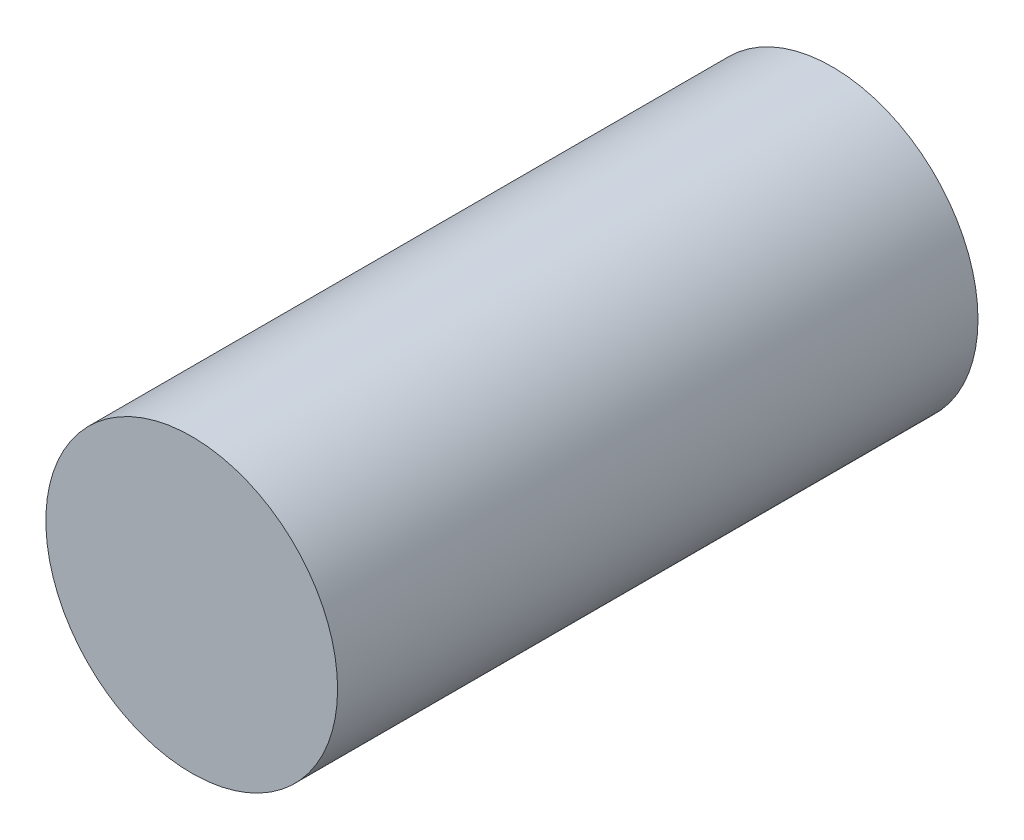
ISO-10303-21;
HEADER;
FILE_DESCRIPTION(('STEP AP214'),'2;1');
FILE_NAME('part.step','',(''),(''),'','','');
FILE_SCHEMA(('AUTOMOTIVE_DESIGN { 1 0 10303 214 1 1 1 1 }'));
ENDSEC;
DATA;
#1=APPLICATION_CONTEXT('core data for automotive mechanical design processes');
#2=APPLICATION_PROTOCOL_DEFINITION('international standard','automotive_design',2000,#1);
#3=PRODUCT_CONTEXT('',#1,'mechanical');
#4=PRODUCT('Part','Part','',(#3));
#5=PRODUCT_RELATED_PRODUCT_CATEGORY('part','',(#4));
#6=PRODUCT_DEFINITION_FORMATION('','',#4);
#7=PRODUCT_DEFINITION_CONTEXT('part definition',#1,'design');
#8=PRODUCT_DEFINITION('design','',#6,#7);
#9=PRODUCT_DEFINITION_SHAPE('','',#8);
#10=(LENGTH_UNIT() NAMED_UNIT(*) SI_UNIT(.MILLI.,.METRE.));
#11=(NAMED_UNIT(*) PLANE_ANGLE_UNIT() SI_UNIT($,.RADIAN.));
#12=(NAMED_UNIT(*) SI_UNIT($,.STERADIAN.) SOLID_ANGLE_UNIT());
#13=UNCERTAINTY_MEASURE_WITH_UNIT(LENGTH_MEASURE(1.E-05),#10,'distance_accuracy_value','');
#14=(GEOMETRIC_REPRESENTATION_CONTEXT(3) GLOBAL_UNCERTAINTY_ASSIGNED_CONTEXT((#13)) GLOBAL_UNIT_ASSIGNED_CONTEXT((#10,
#11,#12)) REPRESENTATION_CONTEXT('',''));
#15=CARTESIAN_POINT('',(0.,0.,0.));
#16=DIRECTION('',(0.,0.,1.));
#17=DIRECTION('',(1.,0.,0.));
#18=AXIS2_PLACEMENT_3D('',#15,#16,#17);
#19=CARTESIAN_POINT('',(0.,-1.27,0.1));
#20=DIRECTION('',(0.,0.,1.));
#21=DIRECTION('',(1.,0.,0.));
#22=AXIS2_PLACEMENT_3D('',#19,#20,#21);
#23=PLANE('',#22);
#24=CARTESIAN_POINT('',(0.,-1.27,0.1));
#25=DIRECTION('',(0.,0.,1.));
#26=DIRECTION('',(1.,0.,0.));
#27=AXIS2_PLACEMENT_3D('',#24,#25,#26);
#28=CIRCLE('',#27,0.41);
#29=CARTESIAN_POINT('',(0.41,-1.27,0.1));
#30=VERTEX_POINT('',#29);
#31=EDGE_CURVE('E17',#30,#30,#28,.F.);
#32=ORIENTED_EDGE('',*,*,#31,.F.);
#33=EDGE_LOOP('',(#32));
#34=FACE_BOUND('',#33,.T.);
#35=ADVANCED_FACE('F14',(#34),#23,.T.);
#36=CARTESIAN_POINT('',(0.,-1.27,-1.7));
#37=DIRECTION('',(0.,0.,1.));
#38=DIRECTION('',(1.,0.,0.));
#39=AXIS2_PLACEMENT_3D('',#36,#37,#38);
#40=PLANE('',#39);
#41=CARTESIAN_POINT('',(0.,-1.27,-1.7));
#42=DIRECTION('',(0.,0.,1.));
#43=DIRECTION('',(1.,0.,0.));
#44=AXIS2_PLACEMENT_3D('',#41,#42,#43);
#45=CIRCLE('',#44,0.41);
#46=CARTESIAN_POINT('',(0.41,-1.27,-1.7));
#47=VERTEX_POINT('',#46);
#48=EDGE_CURVE('E10',#47,#47,#45,.T.);
#49=ORIENTED_EDGE('',*,*,#48,.F.);
#50=EDGE_LOOP('',(#49));
#51=FACE_BOUND('',#50,.T.);
#52=ADVANCED_FACE('F29',(#51),#40,.F.);
#53=CARTESIAN_POINT('',(0.,-1.27,-1.7));
#54=DIRECTION('',(0.,0.,1.));
#55=DIRECTION('',(1.,0.,0.));
#56=AXIS2_PLACEMENT_3D('',#53,#54,#55);
#57=CYLINDRICAL_SURFACE('',#56,0.41);
#58=ORIENTED_EDGE('',*,*,#48,.T.);
#59=EDGE_LOOP('',(#58));
#60=FACE_BOUND('',#59,.T.);
#61=ORIENTED_EDGE('',*,*,#31,.T.);
#62=EDGE_LOOP('',(#61));
#63=FACE_BOUND('',#62,.T.);
#64=ADVANCED_FACE('F26',(#60,#63),#57,.T.);
#65=CLOSED_SHELL('',(#35,#52,#64));
#66=MANIFOLD_SOLID_BREP('B1',#65);
#67=ADVANCED_BREP_SHAPE_REPRESENTATION('',(#18,#66),#14);
#68=SHAPE_DEFINITION_REPRESENTATION(#9,#67);
ENDSEC;
END-ISO-10303-21;
